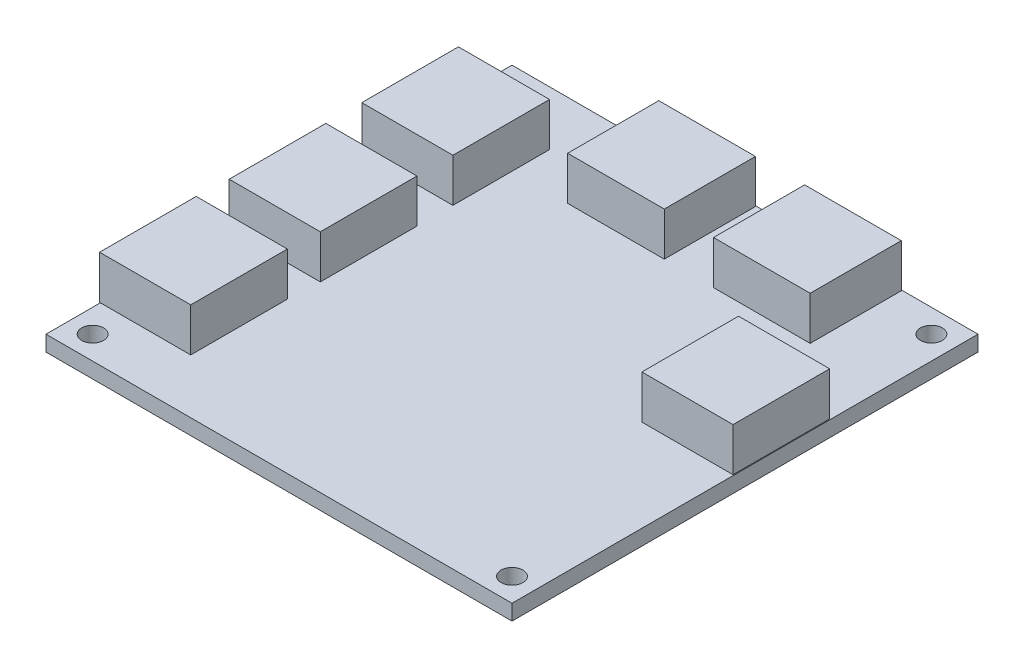
ISO-10303-21;
HEADER;
FILE_DESCRIPTION(('STEP AP214'),'2;1');
FILE_NAME('part.step','',(''),(''),'','','');
FILE_SCHEMA(('AUTOMOTIVE_DESIGN { 1 0 10303 214 1 1 1 1 }'));
ENDSEC;
DATA;
#1=APPLICATION_CONTEXT('core data for automotive mechanical design processes');
#2=APPLICATION_PROTOCOL_DEFINITION('international standard','automotive_design',2000,#1);
#3=PRODUCT_CONTEXT('',#1,'mechanical');
#4=PRODUCT('Part','Part','',(#3));
#5=PRODUCT_RELATED_PRODUCT_CATEGORY('part','',(#4));
#6=PRODUCT_DEFINITION_FORMATION('','',#4);
#7=PRODUCT_DEFINITION_CONTEXT('part definition',#1,'design');
#8=PRODUCT_DEFINITION('design','',#6,#7);
#9=PRODUCT_DEFINITION_SHAPE('','',#8);
#10=(LENGTH_UNIT() NAMED_UNIT(*) SI_UNIT(.MILLI.,.METRE.));
#11=(NAMED_UNIT(*) PLANE_ANGLE_UNIT() SI_UNIT($,.RADIAN.));
#12=(NAMED_UNIT(*) SI_UNIT($,.STERADIAN.) SOLID_ANGLE_UNIT());
#13=UNCERTAINTY_MEASURE_WITH_UNIT(LENGTH_MEASURE(1.E-05),#10,'distance_accuracy_value','');
#14=(GEOMETRIC_REPRESENTATION_CONTEXT(3) GLOBAL_UNCERTAINTY_ASSIGNED_CONTEXT((#13)) GLOBAL_UNIT_ASSIGNED_CONTEXT((#10,
#11,#12)) REPRESENTATION_CONTEXT('',''));
#15=CARTESIAN_POINT('',(0.,0.,0.));
#16=DIRECTION('',(0.,0.,1.));
#17=DIRECTION('',(1.,0.,0.));
#18=AXIS2_PLACEMENT_3D('',#15,#16,#17);
#19=CARTESIAN_POINT('',(0.,2.54,0.));
#20=DIRECTION('',(0.,-1.,0.));
#21=DIRECTION('',(0.,0.,-1.));
#22=AXIS2_PLACEMENT_3D('',#19,#20,#21);
#23=PLANE('',#22);
#24=CARTESIAN_POINT('',(34.29,2.54,34.29));
#25=DIRECTION('',(0.,1.,0.));
#26=DIRECTION('',(0.,0.,1.));
#27=AXIS2_PLACEMENT_3D('',#24,#25,#26);
#28=CIRCLE('',#27,1.786001);
#29=CARTESIAN_POINT('',(34.29,2.54,36.076001));
#30=VERTEX_POINT('',#29);
#31=EDGE_CURVE('E868',#30,#30,#28,.T.);
#32=ORIENTED_EDGE('',*,*,#31,.F.);
#33=EDGE_LOOP('',(#32));
#34=FACE_BOUND('',#33,.T.);
#35=CARTESIAN_POINT('',(-34.29,2.54,34.29));
#36=DIRECTION('',(0.,1.,0.));
#37=DIRECTION('',(0.,0.,1.));
#38=AXIS2_PLACEMENT_3D('',#35,#36,#37);
#39=CIRCLE('',#38,1.786001);
#40=CARTESIAN_POINT('',(-34.29,2.54,36.076001));
#41=VERTEX_POINT('',#40);
#42=EDGE_CURVE('E870',#41,#41,#39,.T.);
#43=ORIENTED_EDGE('',*,*,#42,.F.);
#44=EDGE_LOOP('',(#43));
#45=FACE_BOUND('',#44,.T.);
#46=CARTESIAN_POINT('',(-34.29,2.54,-34.29));
#47=DIRECTION('',(0.,1.,0.));
#48=DIRECTION('',(0.,0.,1.));
#49=AXIS2_PLACEMENT_3D('',#46,#47,#48);
#50=CIRCLE('',#49,1.786001);
#51=CARTESIAN_POINT('',(-34.29,2.54,-32.503999));
#52=VERTEX_POINT('',#51);
#53=EDGE_CURVE('E878',#52,#52,#50,.T.);
#54=ORIENTED_EDGE('',*,*,#53,.F.);
#55=EDGE_LOOP('',(#54));
#56=FACE_BOUND('',#55,.T.);
#57=CARTESIAN_POINT('',(34.29,2.54,-34.29));
#58=DIRECTION('',(0.,1.,0.));
#59=DIRECTION('',(0.,0.,1.));
#60=AXIS2_PLACEMENT_3D('',#57,#58,#59);
#61=CIRCLE('',#60,1.786001);
#62=CARTESIAN_POINT('',(34.29,2.54,-32.503999));
#63=VERTEX_POINT('',#62);
#64=EDGE_CURVE('E884',#63,#63,#61,.T.);
#65=ORIENTED_EDGE('',*,*,#64,.F.);
#66=EDGE_LOOP('',(#65));
#67=FACE_BOUND('',#66,.T.);
#68=DIRECTION('',(0.,0.,-1.));
#69=VECTOR('',#68,1.);
#70=CARTESIAN_POINT('',(25.6818,2.54,-37.973));
#71=LINE('',#70,#69);
#72=CARTESIAN_POINT('',(25.6818,2.54,-23.073));
#73=VERTEX_POINT('',#72);
#74=CARTESIAN_POINT('',(25.6818,2.54,-37.973));
#75=VERTEX_POINT('',#74);
#76=EDGE_CURVE('E249',#73,#75,#71,.T.);
#77=ORIENTED_EDGE('',*,*,#76,.F.);
#78=DIRECTION('',(1.,0.,0.));
#79=VECTOR('',#78,1.);
#80=CARTESIAN_POINT('',(9.8818,2.54,-23.073));
#81=LINE('',#80,#79);
#82=CARTESIAN_POINT('',(9.8818,2.54,-23.073));
#83=VERTEX_POINT('',#82);
#84=EDGE_CURVE('E262',#83,#73,#81,.T.);
#85=ORIENTED_EDGE('',*,*,#84,.F.);
#86=DIRECTION('',(0.,0.,1.));
#87=VECTOR('',#86,1.);
#88=CARTESIAN_POINT('',(9.8818,2.54,-37.973));
#89=LINE('',#88,#87);
#90=CARTESIAN_POINT('',(9.8818,2.54,-37.973));
#91=VERTEX_POINT('',#90);
#92=EDGE_CURVE('E271',#91,#83,#89,.T.);
#93=ORIENTED_EDGE('',*,*,#92,.F.);
#94=DIRECTION('',(-1.,0.,0.));
#95=VECTOR('',#94,1.);
#96=CARTESIAN_POINT('',(9.8818,2.54,-37.973));
#97=LINE('',#96,#95);
#98=EDGE_CURVE('E252',#75,#91,#97,.T.);
#99=ORIENTED_EDGE('',*,*,#98,.F.);
#100=EDGE_LOOP('',(#77,#85,#93,#99));
#101=FACE_BOUND('',#100,.T.);
#102=DIRECTION('',(0.,0.,1.));
#103=VECTOR('',#102,1.);
#104=CARTESIAN_POINT('',(-37.973,2.54,-29.21));
#105=LINE('',#104,#103);
#106=CARTESIAN_POINT('',(-37.973,2.54,-29.21));
#107=VERTEX_POINT('',#106);
#108=CARTESIAN_POINT('',(-37.973,2.54,-13.41));
#109=VERTEX_POINT('',#108);
#110=EDGE_CURVE('E320',#107,#109,#105,.T.);
#111=ORIENTED_EDGE('',*,*,#110,.F.);
#112=DIRECTION('',(-1.,0.,0.));
#113=VECTOR('',#112,1.);
#114=CARTESIAN_POINT('',(-23.073,2.54,-29.21));
#115=LINE('',#114,#113);
#116=CARTESIAN_POINT('',(-23.073,2.54,-29.21));
#117=VERTEX_POINT('',#116);
#118=EDGE_CURVE('E325',#117,#107,#115,.T.);
#119=ORIENTED_EDGE('',*,*,#118,.F.);
#120=DIRECTION('',(0.,0.,-1.));
#121=VECTOR('',#120,1.);
#122=CARTESIAN_POINT('',(-23.073,2.54,-29.21));
#123=LINE('',#122,#121);
#124=CARTESIAN_POINT('',(-23.073,2.54,-13.41));
#125=VERTEX_POINT('',#124);
#126=EDGE_CURVE('E337',#125,#117,#123,.T.);
#127=ORIENTED_EDGE('',*,*,#126,.F.);
#128=DIRECTION('',(1.,0.,0.));
#129=VECTOR('',#128,1.);
#130=CARTESIAN_POINT('',(-23.073,2.54,-13.41));
#131=LINE('',#130,#129);
#132=EDGE_CURVE('E334',#109,#125,#131,.T.);
#133=ORIENTED_EDGE('',*,*,#132,.F.);
#134=EDGE_LOOP('',(#111,#119,#127,#133));
#135=FACE_BOUND('',#134,.T.);
#136=DIRECTION('',(-1.,0.,0.));
#137=VECTOR('',#136,1.);
#138=CARTESIAN_POINT('',(-23.327,2.54,13.41));
#139=LINE('',#138,#137);
#140=CARTESIAN_POINT('',(-23.327,2.54,13.41));
#141=VERTEX_POINT('',#140);
#142=CARTESIAN_POINT('',(-38.1,2.54,13.41));
#143=VERTEX_POINT('',#142);
#144=EDGE_CURVE('E391',#141,#143,#139,.T.);
#145=ORIENTED_EDGE('',*,*,#144,.F.);
#146=DIRECTION('',(0.,0.,-1.));
#147=VECTOR('',#146,1.);
#148=CARTESIAN_POINT('',(-23.327,2.54,13.41));
#149=LINE('',#148,#147);
#150=CARTESIAN_POINT('',(-23.327,2.54,29.21));
#151=VERTEX_POINT('',#150);
#152=EDGE_CURVE('E401',#151,#141,#149,.T.);
#153=ORIENTED_EDGE('',*,*,#152,.F.);
#154=DIRECTION('',(1.,0.,0.));
#155=VECTOR('',#154,1.);
#156=CARTESIAN_POINT('',(-23.327,2.54,29.21));
#157=LINE('',#156,#155);
#158=CARTESIAN_POINT('',(-38.1,2.54,29.21));
#159=VERTEX_POINT('',#158);
#160=EDGE_CURVE('E11',#159,#151,#157,.T.);
#161=ORIENTED_EDGE('',*,*,#160,.F.);
#162=DIRECTION('',(0.,0.,1.));
#163=VECTOR('',#162,1.);
#164=CARTESIAN_POINT('',(-38.1,2.54,-38.1));
#165=LINE('',#164,#163);
#166=CARTESIAN_POINT('',(-38.1,2.54,38.1));
#167=VERTEX_POINT('',#166);
#168=EDGE_CURVE('E426',#159,#167,#165,.T.);
#169=ORIENTED_EDGE('',*,*,#168,.T.);
#170=DIRECTION('',(-1.,0.,0.));
#171=VECTOR('',#170,1.);
#172=CARTESIAN_POINT('',(38.1,2.54,38.1));
#173=LINE('',#172,#171);
#174=CARTESIAN_POINT('',(38.1,2.54,38.1));
#175=VERTEX_POINT('',#174);
#176=EDGE_CURVE('E422',#175,#167,#173,.T.);
#177=ORIENTED_EDGE('',*,*,#176,.F.);
#178=DIRECTION('',(0.,0.,1.));
#179=VECTOR('',#178,1.);
#180=CARTESIAN_POINT('',(38.1,2.54,-38.1));
#181=LINE('',#180,#179);
#182=CARTESIAN_POINT('',(38.1,2.54,-38.1));
#183=VERTEX_POINT('',#182);
#184=EDGE_CURVE('E419',#183,#175,#181,.T.);
#185=ORIENTED_EDGE('',*,*,#184,.F.);
#186=DIRECTION('',(-1.,0.,0.));
#187=VECTOR('',#186,1.);
#188=CARTESIAN_POINT('',(38.1,2.54,-38.1));
#189=LINE('',#188,#187);
#190=CARTESIAN_POINT('',(-38.1,2.54,-38.1));
#191=VERTEX_POINT('',#190);
#192=EDGE_CURVE('E430',#183,#191,#189,.T.);
#193=ORIENTED_EDGE('',*,*,#192,.T.);
#194=EDGE_CURVE('E427',#191,#143,#165,.T.);
#195=ORIENTED_EDGE('',*,*,#194,.T.);
#196=EDGE_LOOP('',(#145,#153,#161,#169,#177,#185,#193,#195));
#197=FACE_BOUND('',#196,.T.);
#198=DIRECTION('',(0.,0.,1.));
#199=VECTOR('',#198,1.);
#200=CARTESIAN_POINT('',(-37.973,2.54,8.27252643294814));
#201=LINE('',#200,#199);
#202=CARTESIAN_POINT('',(-37.973,2.54,-7.52747356705186));
#203=VERTEX_POINT('',#202);
#204=CARTESIAN_POINT('',(-37.973,2.54,8.27252643294814));
#205=VERTEX_POINT('',#204);
#206=EDGE_CURVE('E353',#203,#205,#201,.T.);
#207=ORIENTED_EDGE('',*,*,#206,.F.);
#208=DIRECTION('',(-1.,0.,0.));
#209=VECTOR('',#208,1.);
#210=CARTESIAN_POINT('',(-23.073,2.54,-7.52747356705186));
#211=LINE('',#210,#209);
#212=CARTESIAN_POINT('',(-23.073,2.54,-7.52747356705186));
#213=VERTEX_POINT('',#212);
#214=EDGE_CURVE('E358',#213,#203,#211,.T.);
#215=ORIENTED_EDGE('',*,*,#214,.F.);
#216=DIRECTION('',(0.,0.,-1.));
#217=VECTOR('',#216,1.);
#218=CARTESIAN_POINT('',(-23.073,2.54,8.27252643294814));
#219=LINE('',#218,#217);
#220=CARTESIAN_POINT('',(-23.073,2.54,8.27252643294814));
#221=VERTEX_POINT('',#220);
#222=EDGE_CURVE('E370',#221,#213,#219,.T.);
#223=ORIENTED_EDGE('',*,*,#222,.F.);
#224=DIRECTION('',(1.,0.,0.));
#225=VECTOR('',#224,1.);
#226=CARTESIAN_POINT('',(-23.073,2.54,8.27252643294814));
#227=LINE('',#226,#225);
#228=EDGE_CURVE('E367',#205,#221,#227,.T.);
#229=ORIENTED_EDGE('',*,*,#228,.F.);
#230=EDGE_LOOP('',(#207,#215,#223,#229));
#231=FACE_BOUND('',#230,.T.);
#232=DIRECTION('',(-1.,0.,0.));
#233=VECTOR('',#232,1.);
#234=CARTESIAN_POINT('',(-13.97,2.54,-37.973));
#235=LINE('',#234,#233);
#236=CARTESIAN_POINT('',(1.83,2.54,-37.973));
#237=VERTEX_POINT('',#236);
#238=CARTESIAN_POINT('',(-13.97,2.54,-37.973));
#239=VERTEX_POINT('',#238);
#240=EDGE_CURVE('E287',#237,#239,#235,.T.);
#241=ORIENTED_EDGE('',*,*,#240,.F.);
#242=DIRECTION('',(0.,0.,-1.));
#243=VECTOR('',#242,1.);
#244=CARTESIAN_POINT('',(1.83,2.54,-23.073));
#245=LINE('',#244,#243);
#246=CARTESIAN_POINT('',(1.83,2.54,-23.073));
#247=VERTEX_POINT('',#246);
#248=EDGE_CURVE('E292',#247,#237,#245,.T.);
#249=ORIENTED_EDGE('',*,*,#248,.F.);
#250=DIRECTION('',(1.,0.,0.));
#251=VECTOR('',#250,1.);
#252=CARTESIAN_POINT('',(1.83,2.54,-23.073));
#253=LINE('',#252,#251);
#254=CARTESIAN_POINT('',(-13.97,2.54,-23.073));
#255=VERTEX_POINT('',#254);
#256=EDGE_CURVE('E304',#255,#247,#253,.T.);
#257=ORIENTED_EDGE('',*,*,#256,.F.);
#258=DIRECTION('',(0.,0.,1.));
#259=VECTOR('',#258,1.);
#260=CARTESIAN_POINT('',(-13.97,2.54,-23.073));
#261=LINE('',#260,#259);
#262=EDGE_CURVE('E301',#239,#255,#261,.T.);
#263=ORIENTED_EDGE('',*,*,#262,.F.);
#264=EDGE_LOOP('',(#241,#249,#257,#263));
#265=FACE_BOUND('',#264,.T.);
#266=DIRECTION('',(0.,0.,-1.));
#267=VECTOR('',#266,1.);
#268=CARTESIAN_POINT('',(37.973,2.54,1.83000000000001));
#269=LINE('',#268,#267);
#270=CARTESIAN_POINT('',(37.973,2.54,1.83000000000001));
#271=VERTEX_POINT('',#270);
#272=CARTESIAN_POINT('',(37.973,2.54,-13.97));
#273=VERTEX_POINT('',#272);
#274=EDGE_CURVE('E248',#271,#273,#269,.T.);
#275=ORIENTED_EDGE('',*,*,#274,.F.);
#276=DIRECTION('',(1.,0.,0.));
#277=VECTOR('',#276,1.);
#278=CARTESIAN_POINT('',(23.073,2.54,1.83000000000001));
#279=LINE('',#278,#277);
#280=CARTESIAN_POINT('',(23.073,2.54,1.83000000000001));
#281=VERTEX_POINT('',#280);
#282=EDGE_CURVE('E245',#281,#271,#279,.T.);
#283=ORIENTED_EDGE('',*,*,#282,.F.);
#284=DIRECTION('',(0.,0.,1.));
#285=VECTOR('',#284,1.);
#286=CARTESIAN_POINT('',(23.073,2.54,1.83000000000001));
#287=LINE('',#286,#285);
#288=CARTESIAN_POINT('',(23.073,2.54,-13.97));
#289=VERTEX_POINT('',#288);
#290=EDGE_CURVE('E57',#289,#281,#287,.T.);
#291=ORIENTED_EDGE('',*,*,#290,.F.);
#292=DIRECTION('',(-1.,0.,0.));
#293=VECTOR('',#292,1.);
#294=CARTESIAN_POINT('',(23.073,2.54,-13.97));
#295=LINE('',#294,#293);
#296=EDGE_CURVE('E52',#273,#289,#295,.T.);
#297=ORIENTED_EDGE('',*,*,#296,.F.);
#298=EDGE_LOOP('',(#275,#283,#291,#297));
#299=FACE_BOUND('',#298,.T.);
#300=ADVANCED_FACE('F34',(#34,#45,#56,#67,#101,#135,#197,#231,#265,#299),#23,.F.);
#301=CARTESIAN_POINT('',(38.1,2.54,-38.1));
#302=DIRECTION('',(1.,0.,0.));
#303=DIRECTION('',(0.,0.,-1.));
#304=AXIS2_PLACEMENT_3D('',#301,#302,#303);
#305=PLANE('',#304);
#306=DIRECTION('',(0.,0.,1.));
#307=VECTOR('',#306,1.);
#308=CARTESIAN_POINT('',(38.1,0.,-38.1));
#309=LINE('',#308,#307);
#310=CARTESIAN_POINT('',(38.1,0.,-38.1));
#311=VERTEX_POINT('',#310);
#312=CARTESIAN_POINT('',(38.1,0.,38.1));
#313=VERTEX_POINT('',#312);
#314=EDGE_CURVE('E418',#311,#313,#309,.T.);
#315=ORIENTED_EDGE('',*,*,#314,.F.);
#316=DIRECTION('',(0.,-1.,0.));
#317=VECTOR('',#316,1.);
#318=CARTESIAN_POINT('',(38.1,2.54,-38.1));
#319=LINE('',#318,#317);
#320=EDGE_CURVE('E43',#183,#311,#319,.T.);
#321=ORIENTED_EDGE('',*,*,#320,.F.);
#322=ORIENTED_EDGE('',*,*,#184,.T.);
#323=DIRECTION('',(0.,-1.,0.));
#324=VECTOR('',#323,1.);
#325=CARTESIAN_POINT('',(38.1,2.54,38.1));
#326=LINE('',#325,#324);
#327=EDGE_CURVE('E38',#175,#313,#326,.T.);
#328=ORIENTED_EDGE('',*,*,#327,.T.);
#329=EDGE_LOOP('',(#315,#321,#322,#328));
#330=FACE_BOUND('',#329,.T.);
#331=ADVANCED_FACE('F36',(#330),#305,.T.);
#332=CARTESIAN_POINT('',(38.1,2.54,-38.1));
#333=DIRECTION('',(0.,0.,1.));
#334=DIRECTION('',(1.,0.,0.));
#335=AXIS2_PLACEMENT_3D('',#332,#333,#334);
#336=PLANE('',#335);
#337=DIRECTION('',(-1.,0.,0.));
#338=VECTOR('',#337,1.);
#339=CARTESIAN_POINT('',(38.1,0.,-38.1));
#340=LINE('',#339,#338);
#341=CARTESIAN_POINT('',(-38.1,0.,-38.1));
#342=VERTEX_POINT('',#341);
#343=EDGE_CURVE('E423',#311,#342,#340,.T.);
#344=ORIENTED_EDGE('',*,*,#343,.T.);
#345=DIRECTION('',(0.,-1.,0.));
#346=VECTOR('',#345,1.);
#347=CARTESIAN_POINT('',(-38.1,2.54,-38.1));
#348=LINE('',#347,#346);
#349=EDGE_CURVE('E443',#191,#342,#348,.T.);
#350=ORIENTED_EDGE('',*,*,#349,.F.);
#351=ORIENTED_EDGE('',*,*,#192,.F.);
#352=ORIENTED_EDGE('',*,*,#320,.T.);
#353=EDGE_LOOP('',(#344,#350,#351,#352));
#354=FACE_BOUND('',#353,.T.);
#355=ADVANCED_FACE('F460',(#354),#336,.F.);
#356=CARTESIAN_POINT('',(-38.1,2.54,-38.1));
#357=DIRECTION('',(1.,0.,0.));
#358=DIRECTION('',(0.,0.,-1.));
#359=AXIS2_PLACEMENT_3D('',#356,#357,#358);
#360=PLANE('',#359);
#361=DIRECTION('',(0.,0.,1.));
#362=VECTOR('',#361,1.);
#363=CARTESIAN_POINT('',(-38.1,0.,-38.1));
#364=LINE('',#363,#362);
#365=CARTESIAN_POINT('',(-38.1,0.,38.1));
#366=VERTEX_POINT('',#365);
#367=EDGE_CURVE('E438',#342,#366,#364,.T.);
#368=ORIENTED_EDGE('',*,*,#367,.T.);
#369=DIRECTION('',(0.,-1.,0.));
#370=VECTOR('',#369,1.);
#371=CARTESIAN_POINT('',(-38.1,2.54,38.1));
#372=LINE('',#371,#370);
#373=EDGE_CURVE('E445',#167,#366,#372,.T.);
#374=ORIENTED_EDGE('',*,*,#373,.F.);
#375=ORIENTED_EDGE('',*,*,#168,.F.);
#376=EDGE_CURVE('E431',#143,#159,#165,.T.);
#377=ORIENTED_EDGE('',*,*,#376,.F.);
#378=ORIENTED_EDGE('',*,*,#194,.F.);
#379=ORIENTED_EDGE('',*,*,#349,.T.);
#380=EDGE_LOOP('',(#368,#374,#375,#377,#378,#379));
#381=FACE_BOUND('',#380,.T.);
#382=ADVANCED_FACE('F464',(#381),#360,.F.);
#383=CARTESIAN_POINT('',(38.1,2.54,38.1));
#384=DIRECTION('',(0.,0.,1.));
#385=DIRECTION('',(1.,0.,0.));
#386=AXIS2_PLACEMENT_3D('',#383,#384,#385);
#387=PLANE('',#386);
#388=DIRECTION('',(-1.,0.,0.));
#389=VECTOR('',#388,1.);
#390=CARTESIAN_POINT('',(38.1,0.,38.1));
#391=LINE('',#390,#389);
#392=EDGE_CURVE('E435',#313,#366,#391,.T.);
#393=ORIENTED_EDGE('',*,*,#392,.F.);
#394=ORIENTED_EDGE('',*,*,#327,.F.);
#395=ORIENTED_EDGE('',*,*,#176,.T.);
#396=ORIENTED_EDGE('',*,*,#373,.T.);
#397=EDGE_LOOP('',(#393,#394,#395,#396));
#398=FACE_BOUND('',#397,.T.);
#399=ADVANCED_FACE('F453',(#398),#387,.T.);
#400=CARTESIAN_POINT('',(0.,0.,0.));
#401=DIRECTION('',(0.,-1.,0.));
#402=DIRECTION('',(0.,0.,-1.));
#403=AXIS2_PLACEMENT_3D('',#400,#401,#402);
#404=PLANE('',#403);
#405=CARTESIAN_POINT('',(34.29,0.,34.29));
#406=DIRECTION('',(0.,-1.,0.));
#407=DIRECTION('',(0.,0.,-1.));
#408=AXIS2_PLACEMENT_3D('',#405,#406,#407);
#409=CIRCLE('',#408,1.786001);
#410=CARTESIAN_POINT('',(34.29,0.,32.503999));
#411=VERTEX_POINT('',#410);
#412=EDGE_CURVE('E866',#411,#411,#409,.T.);
#413=ORIENTED_EDGE('',*,*,#412,.F.);
#414=EDGE_LOOP('',(#413));
#415=FACE_BOUND('',#414,.T.);
#416=CARTESIAN_POINT('',(-34.29,0.,34.29));
#417=DIRECTION('',(0.,-1.,0.));
#418=DIRECTION('',(0.,0.,-1.));
#419=AXIS2_PLACEMENT_3D('',#416,#417,#418);
#420=CIRCLE('',#419,1.786001);
#421=CARTESIAN_POINT('',(-34.29,0.,32.503999));
#422=VERTEX_POINT('',#421);
#423=EDGE_CURVE('E875',#422,#422,#420,.T.);
#424=ORIENTED_EDGE('',*,*,#423,.F.);
#425=EDGE_LOOP('',(#424));
#426=FACE_BOUND('',#425,.T.);
#427=CARTESIAN_POINT('',(-34.29,0.,-34.29));
#428=DIRECTION('',(0.,-1.,0.));
#429=DIRECTION('',(0.,0.,-1.));
#430=AXIS2_PLACEMENT_3D('',#427,#428,#429);
#431=CIRCLE('',#430,1.786001);
#432=CARTESIAN_POINT('',(-34.29,0.,-36.076001));
#433=VERTEX_POINT('',#432);
#434=EDGE_CURVE('E881',#433,#433,#431,.T.);
#435=ORIENTED_EDGE('',*,*,#434,.F.);
#436=EDGE_LOOP('',(#435));
#437=FACE_BOUND('',#436,.T.);
#438=CARTESIAN_POINT('',(34.29,0.,-34.29));
#439=DIRECTION('',(0.,-1.,0.));
#440=DIRECTION('',(0.,0.,-1.));
#441=AXIS2_PLACEMENT_3D('',#438,#439,#440);
#442=CIRCLE('',#441,1.786001);
#443=CARTESIAN_POINT('',(34.29,0.,-36.076001));
#444=VERTEX_POINT('',#443);
#445=EDGE_CURVE('E887',#444,#444,#442,.T.);
#446=ORIENTED_EDGE('',*,*,#445,.F.);
#447=EDGE_LOOP('',(#446));
#448=FACE_BOUND('',#447,.T.);
#449=ORIENTED_EDGE('',*,*,#314,.T.);
#450=ORIENTED_EDGE('',*,*,#392,.T.);
#451=ORIENTED_EDGE('',*,*,#367,.F.);
#452=ORIENTED_EDGE('',*,*,#343,.F.);
#453=EDGE_LOOP('',(#449,#450,#451,#452));
#454=FACE_BOUND('',#453,.T.);
#455=ADVANCED_FACE('F457',(#415,#426,#437,#448,#454),#404,.T.);
#456=CARTESIAN_POINT('',(-38.227,9.64,13.41));
#457=DIRECTION('',(1.,0.,0.));
#458=DIRECTION('',(0.,0.,-1.));
#459=AXIS2_PLACEMENT_3D('',#456,#457,#458);
#460=PLANE('',#459);
#461=DIRECTION('',(0.,0.,1.));
#462=VECTOR('',#461,1.);
#463=CARTESIAN_POINT('',(-38.227,2.54,13.41));
#464=LINE('',#463,#462);
#465=CARTESIAN_POINT('',(-38.227,2.54,13.41));
#466=VERTEX_POINT('',#465);
#467=CARTESIAN_POINT('',(-38.227,2.54,29.21));
#468=VERTEX_POINT('',#467);
#469=EDGE_CURVE('E386',#466,#468,#464,.T.);
#470=ORIENTED_EDGE('',*,*,#469,.T.);
#471=DIRECTION('',(0.,-1.,0.));
#472=VECTOR('',#471,1.);
#473=CARTESIAN_POINT('',(-38.227,9.64,29.21));
#474=LINE('',#473,#472);
#475=CARTESIAN_POINT('',(-38.227,9.64,29.21));
#476=VERTEX_POINT('',#475);
#477=EDGE_CURVE('E415',#476,#468,#474,.T.);
#478=ORIENTED_EDGE('',*,*,#477,.F.);
#479=DIRECTION('',(0.,0.,1.));
#480=VECTOR('',#479,1.);
#481=CARTESIAN_POINT('',(-38.227,9.64,13.41));
#482=LINE('',#481,#480);
#483=CARTESIAN_POINT('',(-38.227,9.64,13.41));
#484=VERTEX_POINT('',#483);
#485=EDGE_CURVE('E387',#484,#476,#482,.T.);
#486=ORIENTED_EDGE('',*,*,#485,.F.);
#487=DIRECTION('',(0.,-1.,0.));
#488=VECTOR('',#487,1.);
#489=CARTESIAN_POINT('',(-38.227,9.64,13.41));
#490=LINE('',#489,#488);
#491=EDGE_CURVE('E397',#484,#466,#490,.T.);
#492=ORIENTED_EDGE('',*,*,#491,.T.);
#493=EDGE_LOOP('',(#470,#478,#486,#492));
#494=FACE_BOUND('',#493,.T.);
#495=ADVANCED_FACE('F487',(#494),#460,.F.);
#496=CARTESIAN_POINT('',(-23.327,9.64,29.21));
#497=DIRECTION('',(0.,0.,-1.));
#498=DIRECTION('',(-1.,0.,0.));
#499=AXIS2_PLACEMENT_3D('',#496,#497,#498);
#500=PLANE('',#499);
#501=EDGE_CURVE('E45',#468,#159,#157,.T.);
#502=ORIENTED_EDGE('',*,*,#501,.T.);
#503=ORIENTED_EDGE('',*,*,#160,.T.);
#504=DIRECTION('',(0.,-1.,0.));
#505=VECTOR('',#504,1.);
#506=CARTESIAN_POINT('',(-23.327,9.64,29.21));
#507=LINE('',#506,#505);
#508=CARTESIAN_POINT('',(-23.327,9.64,29.21));
#509=VERTEX_POINT('',#508);
#510=EDGE_CURVE('E412',#509,#151,#507,.T.);
#511=ORIENTED_EDGE('',*,*,#510,.F.);
#512=DIRECTION('',(1.,0.,0.));
#513=VECTOR('',#512,1.);
#514=CARTESIAN_POINT('',(-23.327,9.64,29.21));
#515=LINE('',#514,#513);
#516=EDGE_CURVE('E390',#476,#509,#515,.T.);
#517=ORIENTED_EDGE('',*,*,#516,.F.);
#518=ORIENTED_EDGE('',*,*,#477,.T.);
#519=EDGE_LOOP('',(#502,#503,#511,#517,#518));
#520=FACE_BOUND('',#519,.T.);
#521=ADVANCED_FACE('F483',(#520),#500,.F.);
#522=CARTESIAN_POINT('',(-23.327,9.64,13.41));
#523=DIRECTION('',(-1.,0.,0.));
#524=DIRECTION('',(0.,0.,1.));
#525=AXIS2_PLACEMENT_3D('',#522,#523,#524);
#526=PLANE('',#525);
#527=ORIENTED_EDGE('',*,*,#152,.T.);
#528=DIRECTION('',(0.,-1.,0.));
#529=VECTOR('',#528,1.);
#530=CARTESIAN_POINT('',(-23.327,9.64,13.41));
#531=LINE('',#530,#529);
#532=CARTESIAN_POINT('',(-23.327,9.64,13.41));
#533=VERTEX_POINT('',#532);
#534=EDGE_CURVE('E409',#533,#141,#531,.T.);
#535=ORIENTED_EDGE('',*,*,#534,.F.);
#536=DIRECTION('',(0.,0.,-1.));
#537=VECTOR('',#536,1.);
#538=CARTESIAN_POINT('',(-23.327,9.64,13.41));
#539=LINE('',#538,#537);
#540=EDGE_CURVE('E393',#509,#533,#539,.T.);
#541=ORIENTED_EDGE('',*,*,#540,.F.);
#542=ORIENTED_EDGE('',*,*,#510,.T.);
#543=EDGE_LOOP('',(#527,#535,#541,#542));
#544=FACE_BOUND('',#543,.T.);
#545=ADVANCED_FACE('F480',(#544),#526,.F.);
#546=CARTESIAN_POINT('',(-23.327,9.64,13.41));
#547=DIRECTION('',(0.,0.,1.));
#548=DIRECTION('',(1.,0.,0.));
#549=AXIS2_PLACEMENT_3D('',#546,#547,#548);
#550=PLANE('',#549);
#551=ORIENTED_EDGE('',*,*,#144,.T.);
#552=EDGE_CURVE('E404',#143,#466,#139,.T.);
#553=ORIENTED_EDGE('',*,*,#552,.T.);
#554=ORIENTED_EDGE('',*,*,#491,.F.);
#555=DIRECTION('',(-1.,0.,0.));
#556=VECTOR('',#555,1.);
#557=CARTESIAN_POINT('',(-23.327,9.64,13.41));
#558=LINE('',#557,#556);
#559=EDGE_CURVE('E395',#533,#484,#558,.T.);
#560=ORIENTED_EDGE('',*,*,#559,.F.);
#561=ORIENTED_EDGE('',*,*,#534,.T.);
#562=EDGE_LOOP('',(#551,#553,#554,#560,#561));
#563=FACE_BOUND('',#562,.T.);
#564=ADVANCED_FACE('F475',(#563),#550,.F.);
#565=CARTESIAN_POINT('',(0.,9.64,0.));
#566=DIRECTION('',(0.,-1.,0.));
#567=DIRECTION('',(0.,0.,-1.));
#568=AXIS2_PLACEMENT_3D('',#565,#566,#567);
#569=PLANE('',#568);
#570=ORIENTED_EDGE('',*,*,#485,.T.);
#571=ORIENTED_EDGE('',*,*,#516,.T.);
#572=ORIENTED_EDGE('',*,*,#540,.T.);
#573=ORIENTED_EDGE('',*,*,#559,.T.);
#574=EDGE_LOOP('',(#570,#571,#572,#573));
#575=FACE_BOUND('',#574,.T.);
#576=ADVANCED_FACE('F489',(#575),#569,.F.);
#577=CARTESIAN_POINT('',(0.,2.54,0.));
#578=DIRECTION('',(0.,-1.,0.));
#579=DIRECTION('',(0.,0.,-1.));
#580=AXIS2_PLACEMENT_3D('',#577,#578,#579);
#581=PLANE('',#580);
#582=ORIENTED_EDGE('',*,*,#552,.F.);
#583=ORIENTED_EDGE('',*,*,#376,.T.);
#584=ORIENTED_EDGE('',*,*,#501,.F.);
#585=ORIENTED_EDGE('',*,*,#469,.F.);
#586=EDGE_LOOP('',(#582,#583,#584,#585));
#587=FACE_BOUND('',#586,.T.);
#588=ADVANCED_FACE('F472',(#587),#581,.T.);
#589=CARTESIAN_POINT('',(-37.973,9.64,8.27252643294814));
#590=DIRECTION('',(1.,0.,0.));
#591=DIRECTION('',(0.,0.,-1.));
#592=AXIS2_PLACEMENT_3D('',#589,#590,#591);
#593=PLANE('',#592);
#594=ORIENTED_EDGE('',*,*,#206,.T.);
#595=DIRECTION('',(0.,-1.,0.));
#596=VECTOR('',#595,1.);
#597=CARTESIAN_POINT('',(-37.973,9.64,8.27252643294814));
#598=LINE('',#597,#596);
#599=CARTESIAN_POINT('',(-37.973,9.64,8.27252643294814));
#600=VERTEX_POINT('',#599);
#601=EDGE_CURVE('E383',#600,#205,#598,.T.);
#602=ORIENTED_EDGE('',*,*,#601,.F.);
#603=DIRECTION('',(0.,0.,1.));
#604=VECTOR('',#603,1.);
#605=CARTESIAN_POINT('',(-37.973,9.64,8.27252643294814));
#606=LINE('',#605,#604);
#607=CARTESIAN_POINT('',(-37.973,9.64,-7.52747356705186));
#608=VERTEX_POINT('',#607);
#609=EDGE_CURVE('E354',#608,#600,#606,.T.);
#610=ORIENTED_EDGE('',*,*,#609,.F.);
#611=DIRECTION('',(0.,-1.,0.));
#612=VECTOR('',#611,1.);
#613=CARTESIAN_POINT('',(-37.973,9.64,-7.52747356705186));
#614=LINE('',#613,#612);
#615=EDGE_CURVE('E364',#608,#203,#614,.T.);
#616=ORIENTED_EDGE('',*,*,#615,.T.);
#617=EDGE_LOOP('',(#594,#602,#610,#616));
#618=FACE_BOUND('',#617,.T.);
#619=ADVANCED_FACE('F496',(#618),#593,.F.);
#620=CARTESIAN_POINT('',(-23.073,9.64,8.27252643294814));
#621=DIRECTION('',(0.,0.,-1.));
#622=DIRECTION('',(-1.,0.,0.));
#623=AXIS2_PLACEMENT_3D('',#620,#621,#622);
#624=PLANE('',#623);
#625=ORIENTED_EDGE('',*,*,#228,.T.);
#626=DIRECTION('',(0.,-1.,0.));
#627=VECTOR('',#626,1.);
#628=CARTESIAN_POINT('',(-23.073,9.64,8.27252643294814));
#629=LINE('',#628,#627);
#630=CARTESIAN_POINT('',(-23.073,9.64,8.27252643294814));
#631=VERTEX_POINT('',#630);
#632=EDGE_CURVE('E380',#631,#221,#629,.T.);
#633=ORIENTED_EDGE('',*,*,#632,.F.);
#634=DIRECTION('',(1.,0.,0.));
#635=VECTOR('',#634,1.);
#636=CARTESIAN_POINT('',(-23.073,9.64,8.27252643294814));
#637=LINE('',#636,#635);
#638=EDGE_CURVE('E357',#600,#631,#637,.T.);
#639=ORIENTED_EDGE('',*,*,#638,.F.);
#640=ORIENTED_EDGE('',*,*,#601,.T.);
#641=EDGE_LOOP('',(#625,#633,#639,#640));
#642=FACE_BOUND('',#641,.T.);
#643=ADVANCED_FACE('F567',(#642),#624,.F.);
#644=CARTESIAN_POINT('',(-23.073,9.64,8.27252643294814));
#645=DIRECTION('',(-1.,0.,0.));
#646=DIRECTION('',(0.,0.,1.));
#647=AXIS2_PLACEMENT_3D('',#644,#645,#646);
#648=PLANE('',#647);
#649=ORIENTED_EDGE('',*,*,#222,.T.);
#650=DIRECTION('',(0.,-1.,0.));
#651=VECTOR('',#650,1.);
#652=CARTESIAN_POINT('',(-23.073,9.64,-7.52747356705186));
#653=LINE('',#652,#651);
#654=CARTESIAN_POINT('',(-23.073,9.64,-7.52747356705186));
#655=VERTEX_POINT('',#654);
#656=EDGE_CURVE('E377',#655,#213,#653,.T.);
#657=ORIENTED_EDGE('',*,*,#656,.F.);
#658=DIRECTION('',(0.,0.,-1.));
#659=VECTOR('',#658,1.);
#660=CARTESIAN_POINT('',(-23.073,9.64,8.27252643294814));
#661=LINE('',#660,#659);
#662=EDGE_CURVE('E360',#631,#655,#661,.T.);
#663=ORIENTED_EDGE('',*,*,#662,.F.);
#664=ORIENTED_EDGE('',*,*,#632,.T.);
#665=EDGE_LOOP('',(#649,#657,#663,#664));
#666=FACE_BOUND('',#665,.T.);
#667=ADVANCED_FACE('F576',(#666),#648,.F.);
#668=CARTESIAN_POINT('',(-23.073,9.64,-7.52747356705186));
#669=DIRECTION('',(0.,0.,1.));
#670=DIRECTION('',(1.,0.,0.));
#671=AXIS2_PLACEMENT_3D('',#668,#669,#670);
#672=PLANE('',#671);
#673=ORIENTED_EDGE('',*,*,#214,.T.);
#674=ORIENTED_EDGE('',*,*,#615,.F.);
#675=DIRECTION('',(-1.,0.,0.));
#676=VECTOR('',#675,1.);
#677=CARTESIAN_POINT('',(-23.073,9.64,-7.52747356705186));
#678=LINE('',#677,#676);
#679=EDGE_CURVE('E362',#655,#608,#678,.T.);
#680=ORIENTED_EDGE('',*,*,#679,.F.);
#681=ORIENTED_EDGE('',*,*,#656,.T.);
#682=EDGE_LOOP('',(#673,#674,#680,#681));
#683=FACE_BOUND('',#682,.T.);
#684=ADVANCED_FACE('F586',(#683),#672,.F.);
#685=CARTESIAN_POINT('',(0.,9.64,0.));
#686=DIRECTION('',(0.,1.,0.));
#687=DIRECTION('',(0.,0.,1.));
#688=AXIS2_PLACEMENT_3D('',#685,#686,#687);
#689=PLANE('',#688);
#690=ORIENTED_EDGE('',*,*,#609,.T.);
#691=ORIENTED_EDGE('',*,*,#638,.T.);
#692=ORIENTED_EDGE('',*,*,#662,.T.);
#693=ORIENTED_EDGE('',*,*,#679,.T.);
#694=EDGE_LOOP('',(#690,#691,#692,#693));
#695=FACE_BOUND('',#694,.T.);
#696=ADVANCED_FACE('F596',(#695),#689,.T.);
#697=CARTESIAN_POINT('',(-37.973,9.64,-29.21));
#698=DIRECTION('',(1.,0.,0.));
#699=DIRECTION('',(0.,0.,-1.));
#700=AXIS2_PLACEMENT_3D('',#697,#698,#699);
#701=PLANE('',#700);
#702=ORIENTED_EDGE('',*,*,#110,.T.);
#703=DIRECTION('',(0.,-1.,0.));
#704=VECTOR('',#703,1.);
#705=CARTESIAN_POINT('',(-37.973,9.64,-13.41));
#706=LINE('',#705,#704);
#707=CARTESIAN_POINT('',(-37.973,9.64,-13.41));
#708=VERTEX_POINT('',#707);
#709=EDGE_CURVE('E350',#708,#109,#706,.T.);
#710=ORIENTED_EDGE('',*,*,#709,.F.);
#711=DIRECTION('',(0.,0.,1.));
#712=VECTOR('',#711,1.);
#713=CARTESIAN_POINT('',(-37.973,9.64,-29.21));
#714=LINE('',#713,#712);
#715=CARTESIAN_POINT('',(-37.973,9.64,-29.21));
#716=VERTEX_POINT('',#715);
#717=EDGE_CURVE('E321',#716,#708,#714,.T.);
#718=ORIENTED_EDGE('',*,*,#717,.F.);
#719=DIRECTION('',(0.,-1.,0.));
#720=VECTOR('',#719,1.);
#721=CARTESIAN_POINT('',(-37.973,9.64,-29.21));
#722=LINE('',#721,#720);
#723=EDGE_CURVE('E331',#716,#107,#722,.T.);
#724=ORIENTED_EDGE('',*,*,#723,.T.);
#725=EDGE_LOOP('',(#702,#710,#718,#724));
#726=FACE_BOUND('',#725,.T.);
#727=ADVANCED_FACE('F606',(#726),#701,.F.);
#728=CARTESIAN_POINT('',(-23.073,9.64,-13.41));
#729=DIRECTION('',(0.,0.,-1.));
#730=DIRECTION('',(-1.,0.,0.));
#731=AXIS2_PLACEMENT_3D('',#728,#729,#730);
#732=PLANE('',#731);
#733=ORIENTED_EDGE('',*,*,#132,.T.);
#734=DIRECTION('',(0.,-1.,0.));
#735=VECTOR('',#734,1.);
#736=CARTESIAN_POINT('',(-23.073,9.64,-13.41));
#737=LINE('',#736,#735);
#738=CARTESIAN_POINT('',(-23.073,9.64,-13.41));
#739=VERTEX_POINT('',#738);
#740=EDGE_CURVE('E347',#739,#125,#737,.T.);
#741=ORIENTED_EDGE('',*,*,#740,.F.);
#742=DIRECTION('',(1.,0.,0.));
#743=VECTOR('',#742,1.);
#744=CARTESIAN_POINT('',(-23.073,9.64,-13.41));
#745=LINE('',#744,#743);
#746=EDGE_CURVE('E324',#708,#739,#745,.T.);
#747=ORIENTED_EDGE('',*,*,#746,.F.);
#748=ORIENTED_EDGE('',*,*,#709,.T.);
#749=EDGE_LOOP('',(#733,#741,#747,#748));
#750=FACE_BOUND('',#749,.T.);
#751=ADVANCED_FACE('F616',(#750),#732,.F.);
#752=CARTESIAN_POINT('',(-23.073,9.64,-29.21));
#753=DIRECTION('',(-1.,0.,0.));
#754=DIRECTION('',(0.,0.,1.));
#755=AXIS2_PLACEMENT_3D('',#752,#753,#754);
#756=PLANE('',#755);
#757=ORIENTED_EDGE('',*,*,#126,.T.);
#758=DIRECTION('',(0.,-1.,0.));
#759=VECTOR('',#758,1.);
#760=CARTESIAN_POINT('',(-23.073,9.64,-29.21));
#761=LINE('',#760,#759);
#762=CARTESIAN_POINT('',(-23.073,9.64,-29.21));
#763=VERTEX_POINT('',#762);
#764=EDGE_CURVE('E344',#763,#117,#761,.T.);
#765=ORIENTED_EDGE('',*,*,#764,.F.);
#766=DIRECTION('',(0.,0.,-1.));
#767=VECTOR('',#766,1.);
#768=CARTESIAN_POINT('',(-23.073,9.64,-29.21));
#769=LINE('',#768,#767);
#770=EDGE_CURVE('E327',#739,#763,#769,.T.);
#771=ORIENTED_EDGE('',*,*,#770,.F.);
#772=ORIENTED_EDGE('',*,*,#740,.T.);
#773=EDGE_LOOP('',(#757,#765,#771,#772));
#774=FACE_BOUND('',#773,.T.);
#775=ADVANCED_FACE('F626',(#774),#756,.F.);
#776=CARTESIAN_POINT('',(-23.073,9.64,-29.21));
#777=DIRECTION('',(0.,0.,1.));
#778=DIRECTION('',(1.,0.,0.));
#779=AXIS2_PLACEMENT_3D('',#776,#777,#778);
#780=PLANE('',#779);
#781=ORIENTED_EDGE('',*,*,#118,.T.);
#782=ORIENTED_EDGE('',*,*,#723,.F.);
#783=DIRECTION('',(-1.,0.,0.));
#784=VECTOR('',#783,1.);
#785=CARTESIAN_POINT('',(-23.073,9.64,-29.21));
#786=LINE('',#785,#784);
#787=EDGE_CURVE('E329',#763,#716,#786,.T.);
#788=ORIENTED_EDGE('',*,*,#787,.F.);
#789=ORIENTED_EDGE('',*,*,#764,.T.);
#790=EDGE_LOOP('',(#781,#782,#788,#789));
#791=FACE_BOUND('',#790,.T.);
#792=ADVANCED_FACE('F636',(#791),#780,.F.);
#793=CARTESIAN_POINT('',(0.,9.64,0.));
#794=DIRECTION('',(0.,-1.,0.));
#795=DIRECTION('',(0.,0.,-1.));
#796=AXIS2_PLACEMENT_3D('',#793,#794,#795);
#797=PLANE('',#796);
#798=ORIENTED_EDGE('',*,*,#717,.T.);
#799=ORIENTED_EDGE('',*,*,#746,.T.);
#800=ORIENTED_EDGE('',*,*,#770,.T.);
#801=ORIENTED_EDGE('',*,*,#787,.T.);
#802=EDGE_LOOP('',(#798,#799,#800,#801));
#803=FACE_BOUND('',#802,.T.);
#804=ADVANCED_FACE('F646',(#803),#797,.F.);
#805=CARTESIAN_POINT('',(-13.97,9.64,-37.973));
#806=DIRECTION('',(0.,0.,1.));
#807=DIRECTION('',(1.,0.,0.));
#808=AXIS2_PLACEMENT_3D('',#805,#806,#807);
#809=PLANE('',#808);
#810=ORIENTED_EDGE('',*,*,#240,.T.);
#811=DIRECTION('',(0.,-1.,0.));
#812=VECTOR('',#811,1.);
#813=CARTESIAN_POINT('',(-13.97,9.64,-37.973));
#814=LINE('',#813,#812);
#815=CARTESIAN_POINT('',(-13.97,9.64,-37.973));
#816=VERTEX_POINT('',#815);
#817=EDGE_CURVE('E317',#816,#239,#814,.T.);
#818=ORIENTED_EDGE('',*,*,#817,.F.);
#819=DIRECTION('',(-1.,0.,0.));
#820=VECTOR('',#819,1.);
#821=CARTESIAN_POINT('',(-13.97,9.64,-37.973));
#822=LINE('',#821,#820);
#823=CARTESIAN_POINT('',(1.83,9.64,-37.973));
#824=VERTEX_POINT('',#823);
#825=EDGE_CURVE('E288',#824,#816,#822,.T.);
#826=ORIENTED_EDGE('',*,*,#825,.F.);
#827=DIRECTION('',(0.,-1.,0.));
#828=VECTOR('',#827,1.);
#829=CARTESIAN_POINT('',(1.83,9.64,-37.973));
#830=LINE('',#829,#828);
#831=EDGE_CURVE('E298',#824,#237,#830,.T.);
#832=ORIENTED_EDGE('',*,*,#831,.T.);
#833=EDGE_LOOP('',(#810,#818,#826,#832));
#834=FACE_BOUND('',#833,.T.);
#835=ADVANCED_FACE('F656',(#834),#809,.F.);
#836=CARTESIAN_POINT('',(-13.97,9.64,-23.073));
#837=DIRECTION('',(1.,0.,0.));
#838=DIRECTION('',(0.,0.,-1.));
#839=AXIS2_PLACEMENT_3D('',#836,#837,#838);
#840=PLANE('',#839);
#841=ORIENTED_EDGE('',*,*,#262,.T.);
#842=DIRECTION('',(0.,-1.,0.));
#843=VECTOR('',#842,1.);
#844=CARTESIAN_POINT('',(-13.97,9.64,-23.073));
#845=LINE('',#844,#843);
#846=CARTESIAN_POINT('',(-13.97,9.64,-23.073));
#847=VERTEX_POINT('',#846);
#848=EDGE_CURVE('E314',#847,#255,#845,.T.);
#849=ORIENTED_EDGE('',*,*,#848,.F.);
#850=DIRECTION('',(0.,0.,1.));
#851=VECTOR('',#850,1.);
#852=CARTESIAN_POINT('',(-13.97,9.64,-23.073));
#853=LINE('',#852,#851);
#854=EDGE_CURVE('E291',#816,#847,#853,.T.);
#855=ORIENTED_EDGE('',*,*,#854,.F.);
#856=ORIENTED_EDGE('',*,*,#817,.T.);
#857=EDGE_LOOP('',(#841,#849,#855,#856));
#858=FACE_BOUND('',#857,.T.);
#859=ADVANCED_FACE('F666',(#858),#840,.F.);
#860=CARTESIAN_POINT('',(1.83,9.64,-23.073));
#861=DIRECTION('',(0.,0.,-1.));
#862=DIRECTION('',(-1.,0.,0.));
#863=AXIS2_PLACEMENT_3D('',#860,#861,#862);
#864=PLANE('',#863);
#865=ORIENTED_EDGE('',*,*,#256,.T.);
#866=DIRECTION('',(0.,-1.,0.));
#867=VECTOR('',#866,1.);
#868=CARTESIAN_POINT('',(1.83,9.64,-23.073));
#869=LINE('',#868,#867);
#870=CARTESIAN_POINT('',(1.83,9.64,-23.073));
#871=VERTEX_POINT('',#870);
#872=EDGE_CURVE('E311',#871,#247,#869,.T.);
#873=ORIENTED_EDGE('',*,*,#872,.F.);
#874=DIRECTION('',(1.,0.,0.));
#875=VECTOR('',#874,1.);
#876=CARTESIAN_POINT('',(1.83,9.64,-23.073));
#877=LINE('',#876,#875);
#878=EDGE_CURVE('E294',#847,#871,#877,.T.);
#879=ORIENTED_EDGE('',*,*,#878,.F.);
#880=ORIENTED_EDGE('',*,*,#848,.T.);
#881=EDGE_LOOP('',(#865,#873,#879,#880));
#882=FACE_BOUND('',#881,.T.);
#883=ADVANCED_FACE('F676',(#882),#864,.F.);
#884=CARTESIAN_POINT('',(1.83,9.64,-23.073));
#885=DIRECTION('',(-1.,0.,0.));
#886=DIRECTION('',(0.,0.,1.));
#887=AXIS2_PLACEMENT_3D('',#884,#885,#886);
#888=PLANE('',#887);
#889=ORIENTED_EDGE('',*,*,#248,.T.);
#890=ORIENTED_EDGE('',*,*,#831,.F.);
#891=DIRECTION('',(0.,0.,-1.));
#892=VECTOR('',#891,1.);
#893=CARTESIAN_POINT('',(1.83,9.64,-23.073));
#894=LINE('',#893,#892);
#895=EDGE_CURVE('E296',#871,#824,#894,.T.);
#896=ORIENTED_EDGE('',*,*,#895,.F.);
#897=ORIENTED_EDGE('',*,*,#872,.T.);
#898=EDGE_LOOP('',(#889,#890,#896,#897));
#899=FACE_BOUND('',#898,.T.);
#900=ADVANCED_FACE('F686',(#899),#888,.F.);
#901=CARTESIAN_POINT('',(0.,9.64,0.));
#902=DIRECTION('',(0.,1.,0.));
#903=DIRECTION('',(0.,0.,1.));
#904=AXIS2_PLACEMENT_3D('',#901,#902,#903);
#905=PLANE('',#904);
#906=ORIENTED_EDGE('',*,*,#825,.T.);
#907=ORIENTED_EDGE('',*,*,#854,.T.);
#908=ORIENTED_EDGE('',*,*,#878,.T.);
#909=ORIENTED_EDGE('',*,*,#895,.T.);
#910=EDGE_LOOP('',(#906,#907,#908,#909));
#911=FACE_BOUND('',#910,.T.);
#912=ADVANCED_FACE('F696',(#911),#905,.T.);
#913=CARTESIAN_POINT('',(25.6818,9.64,-37.973));
#914=DIRECTION('',(-1.,0.,0.));
#915=DIRECTION('',(0.,0.,1.));
#916=AXIS2_PLACEMENT_3D('',#913,#914,#915);
#917=PLANE('',#916);
#918=ORIENTED_EDGE('',*,*,#76,.T.);
#919=DIRECTION('',(0.,-1.,0.));
#920=VECTOR('',#919,1.);
#921=CARTESIAN_POINT('',(25.6818,9.64,-37.973));
#922=LINE('',#921,#920);
#923=CARTESIAN_POINT('',(25.6818,9.64,-37.973));
#924=VERTEX_POINT('',#923);
#925=EDGE_CURVE('E284',#924,#75,#922,.T.);
#926=ORIENTED_EDGE('',*,*,#925,.F.);
#927=DIRECTION('',(0.,0.,-1.));
#928=VECTOR('',#927,1.);
#929=CARTESIAN_POINT('',(25.6818,9.64,-37.973));
#930=LINE('',#929,#928);
#931=CARTESIAN_POINT('',(25.6818,9.64,-23.073));
#932=VERTEX_POINT('',#931);
#933=EDGE_CURVE('E258',#932,#924,#930,.T.);
#934=ORIENTED_EDGE('',*,*,#933,.F.);
#935=DIRECTION('',(0.,-1.,0.));
#936=VECTOR('',#935,1.);
#937=CARTESIAN_POINT('',(25.6818,9.64,-23.073));
#938=LINE('',#937,#936);
#939=EDGE_CURVE('E267',#932,#73,#938,.T.);
#940=ORIENTED_EDGE('',*,*,#939,.T.);
#941=EDGE_LOOP('',(#918,#926,#934,#940));
#942=FACE_BOUND('',#941,.T.);
#943=ADVANCED_FACE('F706',(#942),#917,.F.);
#944=CARTESIAN_POINT('',(9.8818,9.64,-37.973));
#945=DIRECTION('',(0.,0.,1.));
#946=DIRECTION('',(1.,0.,0.));
#947=AXIS2_PLACEMENT_3D('',#944,#945,#946);
#948=PLANE('',#947);
#949=ORIENTED_EDGE('',*,*,#98,.T.);
#950=DIRECTION('',(0.,-1.,0.));
#951=VECTOR('',#950,1.);
#952=CARTESIAN_POINT('',(9.8818,9.64,-37.973));
#953=LINE('',#952,#951);
#954=CARTESIAN_POINT('',(9.8818,9.64,-37.973));
#955=VERTEX_POINT('',#954);
#956=EDGE_CURVE('E281',#955,#91,#953,.T.);
#957=ORIENTED_EDGE('',*,*,#956,.F.);
#958=DIRECTION('',(-1.,0.,0.));
#959=VECTOR('',#958,1.);
#960=CARTESIAN_POINT('',(9.8818,9.64,-37.973));
#961=LINE('',#960,#959);
#962=EDGE_CURVE('E261',#924,#955,#961,.T.);
#963=ORIENTED_EDGE('',*,*,#962,.F.);
#964=ORIENTED_EDGE('',*,*,#925,.T.);
#965=EDGE_LOOP('',(#949,#957,#963,#964));
#966=FACE_BOUND('',#965,.T.);
#967=ADVANCED_FACE('F716',(#966),#948,.F.);
#968=CARTESIAN_POINT('',(9.8818,9.64,-37.973));
#969=DIRECTION('',(1.,0.,0.));
#970=DIRECTION('',(0.,0.,-1.));
#971=AXIS2_PLACEMENT_3D('',#968,#969,#970);
#972=PLANE('',#971);
#973=ORIENTED_EDGE('',*,*,#92,.T.);
#974=DIRECTION('',(0.,-1.,0.));
#975=VECTOR('',#974,1.);
#976=CARTESIAN_POINT('',(9.8818,9.64,-23.073));
#977=LINE('',#976,#975);
#978=CARTESIAN_POINT('',(9.8818,9.64,-23.073));
#979=VERTEX_POINT('',#978);
#980=EDGE_CURVE('E278',#979,#83,#977,.T.);
#981=ORIENTED_EDGE('',*,*,#980,.F.);
#982=DIRECTION('',(0.,0.,1.));
#983=VECTOR('',#982,1.);
#984=CARTESIAN_POINT('',(9.8818,9.64,-37.973));
#985=LINE('',#984,#983);
#986=EDGE_CURVE('E264',#955,#979,#985,.T.);
#987=ORIENTED_EDGE('',*,*,#986,.F.);
#988=ORIENTED_EDGE('',*,*,#956,.T.);
#989=EDGE_LOOP('',(#973,#981,#987,#988));
#990=FACE_BOUND('',#989,.T.);
#991=ADVANCED_FACE('F726',(#990),#972,.F.);
#992=CARTESIAN_POINT('',(9.8818,9.64,-23.073));
#993=DIRECTION('',(0.,0.,-1.));
#994=DIRECTION('',(-1.,0.,0.));
#995=AXIS2_PLACEMENT_3D('',#992,#993,#994);
#996=PLANE('',#995);
#997=ORIENTED_EDGE('',*,*,#84,.T.);
#998=ORIENTED_EDGE('',*,*,#939,.F.);
#999=DIRECTION('',(1.,0.,0.));
#1000=VECTOR('',#999,1.);
#1001=CARTESIAN_POINT('',(9.8818,9.64,-23.073));
#1002=LINE('',#1001,#1000);
#1003=EDGE_CURVE('E266',#979,#932,#1002,.T.);
#1004=ORIENTED_EDGE('',*,*,#1003,.F.);
#1005=ORIENTED_EDGE('',*,*,#980,.T.);
#1006=EDGE_LOOP('',(#997,#998,#1004,#1005));
#1007=FACE_BOUND('',#1006,.T.);
#1008=ADVANCED_FACE('F736',(#1007),#996,.F.);
#1009=CARTESIAN_POINT('',(0.,9.64,0.));
#1010=DIRECTION('',(0.,1.,0.));
#1011=DIRECTION('',(0.,0.,1.));
#1012=AXIS2_PLACEMENT_3D('',#1009,#1010,#1011);
#1013=PLANE('',#1012);
#1014=ORIENTED_EDGE('',*,*,#933,.T.);
#1015=ORIENTED_EDGE('',*,*,#962,.T.);
#1016=ORIENTED_EDGE('',*,*,#986,.T.);
#1017=ORIENTED_EDGE('',*,*,#1003,.T.);
#1018=EDGE_LOOP('',(#1014,#1015,#1016,#1017));
#1019=FACE_BOUND('',#1018,.T.);
#1020=ADVANCED_FACE('F746',(#1019),#1013,.T.);
#1021=CARTESIAN_POINT('',(37.973,9.64,1.83000000000001));
#1022=DIRECTION('',(-1.,0.,0.));
#1023=DIRECTION('',(0.,0.,1.));
#1024=AXIS2_PLACEMENT_3D('',#1021,#1022,#1023);
#1025=PLANE('',#1024);
#1026=ORIENTED_EDGE('',*,*,#274,.T.);
#1027=DIRECTION('',(0.,-1.,0.));
#1028=VECTOR('',#1027,1.);
#1029=CARTESIAN_POINT('',(37.973,9.64,-13.97));
#1030=LINE('',#1029,#1028);
#1031=CARTESIAN_POINT('',(37.973,9.64,-13.97));
#1032=VERTEX_POINT('',#1031);
#1033=EDGE_CURVE('E229',#1032,#273,#1030,.T.);
#1034=ORIENTED_EDGE('',*,*,#1033,.F.);
#1035=DIRECTION('',(0.,0.,-1.));
#1036=VECTOR('',#1035,1.);
#1037=CARTESIAN_POINT('',(37.973,9.64,1.83000000000001));
#1038=LINE('',#1037,#1036);
#1039=CARTESIAN_POINT('',(37.973,9.64,1.83000000000001));
#1040=VERTEX_POINT('',#1039);
#1041=EDGE_CURVE('E236',#1040,#1032,#1038,.T.);
#1042=ORIENTED_EDGE('',*,*,#1041,.F.);
#1043=DIRECTION('',(0.,-1.,0.));
#1044=VECTOR('',#1043,1.);
#1045=CARTESIAN_POINT('',(37.973,9.64,1.83000000000001));
#1046=LINE('',#1045,#1044);
#1047=EDGE_CURVE('E892',#1040,#271,#1046,.T.);
#1048=ORIENTED_EDGE('',*,*,#1047,.T.);
#1049=EDGE_LOOP('',(#1026,#1034,#1042,#1048));
#1050=FACE_BOUND('',#1049,.T.);
#1051=ADVANCED_FACE('F247',(#1050),#1025,.F.);
#1052=CARTESIAN_POINT('',(23.073,9.64,-13.97));
#1053=DIRECTION('',(0.,0.,1.));
#1054=DIRECTION('',(1.,0.,0.));
#1055=AXIS2_PLACEMENT_3D('',#1052,#1053,#1054);
#1056=PLANE('',#1055);
#1057=ORIENTED_EDGE('',*,*,#296,.T.);
#1058=DIRECTION('',(0.,-1.,0.));
#1059=VECTOR('',#1058,1.);
#1060=CARTESIAN_POINT('',(23.073,9.64,-13.97));
#1061=LINE('',#1060,#1059);
#1062=CARTESIAN_POINT('',(23.073,9.64,-13.97));
#1063=VERTEX_POINT('',#1062);
#1064=EDGE_CURVE('E232',#1063,#289,#1061,.T.);
#1065=ORIENTED_EDGE('',*,*,#1064,.F.);
#1066=DIRECTION('',(-1.,0.,0.));
#1067=VECTOR('',#1066,1.);
#1068=CARTESIAN_POINT('',(23.073,9.64,-13.97));
#1069=LINE('',#1068,#1067);
#1070=EDGE_CURVE('E225',#1032,#1063,#1069,.T.);
#1071=ORIENTED_EDGE('',*,*,#1070,.F.);
#1072=ORIENTED_EDGE('',*,*,#1033,.T.);
#1073=EDGE_LOOP('',(#1057,#1065,#1071,#1072));
#1074=FACE_BOUND('',#1073,.T.);
#1075=ADVANCED_FACE('F227',(#1074),#1056,.F.);
#1076=CARTESIAN_POINT('',(23.073,9.64,1.83000000000001));
#1077=DIRECTION('',(1.,0.,0.));
#1078=DIRECTION('',(0.,0.,-1.));
#1079=AXIS2_PLACEMENT_3D('',#1076,#1077,#1078);
#1080=PLANE('',#1079);
#1081=ORIENTED_EDGE('',*,*,#290,.T.);
#1082=DIRECTION('',(0.,-1.,0.));
#1083=VECTOR('',#1082,1.);
#1084=CARTESIAN_POINT('',(23.073,9.64,1.83000000000001));
#1085=LINE('',#1084,#1083);
#1086=CARTESIAN_POINT('',(23.073,9.64,1.83000000000001));
#1087=VERTEX_POINT('',#1086);
#1088=EDGE_CURVE('E254',#1087,#281,#1085,.T.);
#1089=ORIENTED_EDGE('',*,*,#1088,.F.);
#1090=DIRECTION('',(0.,0.,1.));
#1091=VECTOR('',#1090,1.);
#1092=CARTESIAN_POINT('',(23.073,9.64,1.83000000000001));
#1093=LINE('',#1092,#1091);
#1094=EDGE_CURVE('E235',#1063,#1087,#1093,.T.);
#1095=ORIENTED_EDGE('',*,*,#1094,.F.);
#1096=ORIENTED_EDGE('',*,*,#1064,.T.);
#1097=EDGE_LOOP('',(#1081,#1089,#1095,#1096));
#1098=FACE_BOUND('',#1097,.T.);
#1099=ADVANCED_FACE('F773',(#1098),#1080,.F.);
#1100=CARTESIAN_POINT('',(23.073,9.64,1.83000000000001));
#1101=DIRECTION('',(0.,0.,-1.));
#1102=DIRECTION('',(-1.,0.,0.));
#1103=AXIS2_PLACEMENT_3D('',#1100,#1101,#1102);
#1104=PLANE('',#1103);
#1105=ORIENTED_EDGE('',*,*,#282,.T.);
#1106=ORIENTED_EDGE('',*,*,#1047,.F.);
#1107=DIRECTION('',(1.,0.,0.));
#1108=VECTOR('',#1107,1.);
#1109=CARTESIAN_POINT('',(23.073,9.64,1.83000000000001));
#1110=LINE('',#1109,#1108);
#1111=EDGE_CURVE('E241',#1087,#1040,#1110,.T.);
#1112=ORIENTED_EDGE('',*,*,#1111,.F.);
#1113=ORIENTED_EDGE('',*,*,#1088,.T.);
#1114=EDGE_LOOP('',(#1105,#1106,#1112,#1113));
#1115=FACE_BOUND('',#1114,.T.);
#1116=ADVANCED_FACE('F782',(#1115),#1104,.F.);
#1117=CARTESIAN_POINT('',(0.,9.64,0.));
#1118=DIRECTION('',(0.,-1.,0.));
#1119=DIRECTION('',(0.,0.,-1.));
#1120=AXIS2_PLACEMENT_3D('',#1117,#1118,#1119);
#1121=PLANE('',#1120);
#1122=ORIENTED_EDGE('',*,*,#1041,.T.);
#1123=ORIENTED_EDGE('',*,*,#1070,.T.);
#1124=ORIENTED_EDGE('',*,*,#1094,.T.);
#1125=ORIENTED_EDGE('',*,*,#1111,.T.);
#1126=EDGE_LOOP('',(#1122,#1123,#1124,#1125));
#1127=FACE_BOUND('',#1126,.T.);
#1128=ADVANCED_FACE('F239',(#1127),#1121,.F.);
#1129=CARTESIAN_POINT('',(34.29,2.54,-34.29));
#1130=DIRECTION('',(0.,1.,0.));
#1131=DIRECTION('',(0.,0.,1.));
#1132=AXIS2_PLACEMENT_3D('',#1129,#1130,#1131);
#1133=CYLINDRICAL_SURFACE('',#1132,1.786001);
#1134=ORIENTED_EDGE('',*,*,#445,.T.);
#1135=EDGE_LOOP('',(#1134));
#1136=FACE_BOUND('',#1135,.T.);
#1137=ORIENTED_EDGE('',*,*,#64,.T.);
#1138=EDGE_LOOP('',(#1137));
#1139=FACE_BOUND('',#1138,.T.);
#1140=ADVANCED_FACE('F801',(#1136,#1139),#1133,.F.);
#1141=CARTESIAN_POINT('',(-34.29,2.54,-34.29));
#1142=DIRECTION('',(0.,1.,0.));
#1143=DIRECTION('',(0.,0.,1.));
#1144=AXIS2_PLACEMENT_3D('',#1141,#1142,#1143);
#1145=CYLINDRICAL_SURFACE('',#1144,1.786001);
#1146=ORIENTED_EDGE('',*,*,#434,.T.);
#1147=EDGE_LOOP('',(#1146));
#1148=FACE_BOUND('',#1147,.T.);
#1149=ORIENTED_EDGE('',*,*,#53,.T.);
#1150=EDGE_LOOP('',(#1149));
#1151=FACE_BOUND('',#1150,.T.);
#1152=ADVANCED_FACE('F823',(#1148,#1151),#1145,.F.);
#1153=CARTESIAN_POINT('',(-34.29,2.54,34.29));
#1154=DIRECTION('',(0.,1.,0.));
#1155=DIRECTION('',(0.,0.,1.));
#1156=AXIS2_PLACEMENT_3D('',#1153,#1154,#1155);
#1157=CYLINDRICAL_SURFACE('',#1156,1.786001);
#1158=ORIENTED_EDGE('',*,*,#423,.T.);
#1159=EDGE_LOOP('',(#1158));
#1160=FACE_BOUND('',#1159,.T.);
#1161=ORIENTED_EDGE('',*,*,#42,.T.);
#1162=EDGE_LOOP('',(#1161));
#1163=FACE_BOUND('',#1162,.T.);
#1164=ADVANCED_FACE('F834',(#1160,#1163),#1157,.F.);
#1165=CARTESIAN_POINT('',(34.29,2.54,34.29));
#1166=DIRECTION('',(0.,1.,0.));
#1167=DIRECTION('',(0.,0.,1.));
#1168=AXIS2_PLACEMENT_3D('',#1165,#1166,#1167);
#1169=CYLINDRICAL_SURFACE('',#1168,1.786001);
#1170=ORIENTED_EDGE('',*,*,#412,.T.);
#1171=EDGE_LOOP('',(#1170));
#1172=FACE_BOUND('',#1171,.T.);
#1173=ORIENTED_EDGE('',*,*,#31,.T.);
#1174=EDGE_LOOP('',(#1173));
#1175=FACE_BOUND('',#1174,.T.);
#1176=ADVANCED_FACE('F844',(#1172,#1175),#1169,.F.);
#1177=CLOSED_SHELL('',(#300,#331,#355,#382,#399,#455,#495,#521,#545,#564,#576,#588,#619,#643,
#667,#684,#696,#727,#751,#775,#792,#804,#835,#859,#883,#900,#912,#943,#967,#991,#1008,#1020,
#1051,#1075,#1099,#1116,#1128,#1140,#1152,#1164,#1176));
#1178=MANIFOLD_SOLID_BREP('B2',#1177);
#1179=ADVANCED_BREP_SHAPE_REPRESENTATION('',(#18,#1178),#14);
#1180=SHAPE_DEFINITION_REPRESENTATION(#9,#1179);
ENDSEC;
END-ISO-10303-21;
